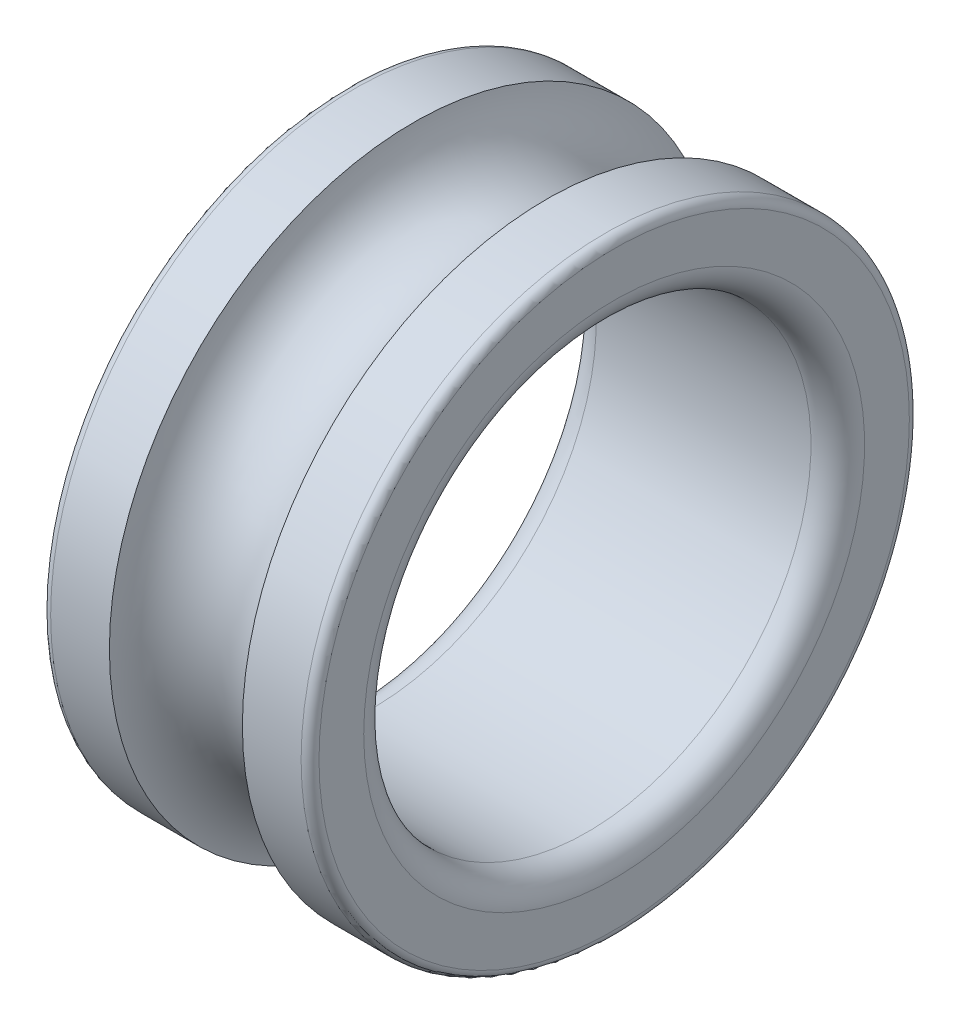
ISO-10303-21;
HEADER;
FILE_DESCRIPTION(('STEP AP214'),'2;1');
FILE_NAME('part.step','',(''),(''),'','','');
FILE_SCHEMA(('AUTOMOTIVE_DESIGN { 1 0 10303 214 1 1 1 1 }'));
ENDSEC;
DATA;
#1=APPLICATION_CONTEXT('core data for automotive mechanical design processes');
#2=APPLICATION_PROTOCOL_DEFINITION('international standard','automotive_design',2000,#1);
#3=PRODUCT_CONTEXT('',#1,'mechanical');
#4=PRODUCT('Part','Part','',(#3));
#5=PRODUCT_RELATED_PRODUCT_CATEGORY('part','',(#4));
#6=PRODUCT_DEFINITION_FORMATION('','',#4);
#7=PRODUCT_DEFINITION_CONTEXT('part definition',#1,'design');
#8=PRODUCT_DEFINITION('design','',#6,#7);
#9=PRODUCT_DEFINITION_SHAPE('','',#8);
#10=(LENGTH_UNIT() NAMED_UNIT(*) SI_UNIT(.MILLI.,.METRE.));
#11=(NAMED_UNIT(*) PLANE_ANGLE_UNIT() SI_UNIT($,.RADIAN.));
#12=(NAMED_UNIT(*) SI_UNIT($,.STERADIAN.) SOLID_ANGLE_UNIT());
#13=UNCERTAINTY_MEASURE_WITH_UNIT(LENGTH_MEASURE(1.E-05),#10,'distance_accuracy_value','');
#14=(GEOMETRIC_REPRESENTATION_CONTEXT(3) GLOBAL_UNCERTAINTY_ASSIGNED_CONTEXT((#13)) GLOBAL_UNIT_ASSIGNED_CONTEXT((#10,
#11,#12)) REPRESENTATION_CONTEXT('',''));
#15=CARTESIAN_POINT('',(0.,0.,0.));
#16=DIRECTION('',(0.,0.,1.));
#17=DIRECTION('',(1.,0.,0.));
#18=AXIS2_PLACEMENT_3D('',#15,#16,#17);
#19=CARTESIAN_POINT('',(2.35,0.,0.));
#20=DIRECTION('',(-1.,0.,0.));
#21=DIRECTION('',(0.,0.,1.));
#22=AXIS2_PLACEMENT_3D('',#19,#20,#21);
#23=TOROIDAL_SURFACE('',#22,3.3,0.099999999999997);
#24=CARTESIAN_POINT('',(2.35,0.,0.));
#25=DIRECTION('',(-1.,0.,0.));
#26=DIRECTION('',(0.,0.,1.));
#27=AXIS2_PLACEMENT_3D('',#24,#25,#26);
#28=CIRCLE('',#27,3.4);
#29=CARTESIAN_POINT('',(2.35,0.,3.4));
#30=VERTEX_POINT('',#29);
#31=EDGE_CURVE('E10',#30,#30,#28,.T.);
#32=ORIENTED_EDGE('',*,*,#31,.T.);
#33=EDGE_LOOP('',(#32));
#34=FACE_BOUND('',#33,.T.);
#35=CARTESIAN_POINT('',(2.25,0.,0.));
#36=DIRECTION('',(-1.,0.,0.));
#37=DIRECTION('',(0.,0.,1.));
#38=AXIS2_PLACEMENT_3D('',#35,#36,#37);
#39=CIRCLE('',#38,3.3);
#40=CARTESIAN_POINT('',(2.25,0.,3.3));
#41=VERTEX_POINT('',#40);
#42=EDGE_CURVE('E69',#41,#41,#39,.T.);
#43=ORIENTED_EDGE('',*,*,#42,.F.);
#44=EDGE_LOOP('',(#43));
#45=FACE_BOUND('',#44,.T.);
#46=ADVANCED_FACE('F35',(#34,#45),#23,.T.);
#47=CARTESIAN_POINT('',(7.0012539936204,0.,0.));
#48=DIRECTION('',(-1.,0.,0.));
#49=DIRECTION('',(0.,0.,1.));
#50=AXIS2_PLACEMENT_3D('',#47,#48,#49);
#51=CYLINDRICAL_SURFACE('',#50,3.4);
#52=CARTESIAN_POINT('',(3.00669656263407,0.,0.));
#53=DIRECTION('',(-1.,0.,0.));
#54=DIRECTION('',(0.,0.,1.));
#55=AXIS2_PLACEMENT_3D('',#52,#53,#54);
#56=CIRCLE('',#55,3.4);
#57=CARTESIAN_POINT('',(3.00669656263407,0.,3.4));
#58=VERTEX_POINT('',#57);
#59=EDGE_CURVE('E41',#58,#58,#56,.T.);
#60=ORIENTED_EDGE('',*,*,#59,.T.);
#61=EDGE_LOOP('',(#60));
#62=FACE_BOUND('',#61,.T.);
#63=ORIENTED_EDGE('',*,*,#31,.F.);
#64=EDGE_LOOP('',(#63));
#65=FACE_BOUND('',#64,.T.);
#66=ADVANCED_FACE('F77',(#62,#65),#51,.T.);
#67=CARTESIAN_POINT('',(3.75,0.,0.));
#68=DIRECTION('',(-1.,0.,0.));
#69=DIRECTION('',(0.,0.,1.));
#70=AXIS2_PLACEMENT_3D('',#67,#68,#69);
#71=TOROIDAL_SURFACE('',#70,3.5,0.75);
#72=CARTESIAN_POINT('',(4.49330343736592,0.,0.));
#73=DIRECTION('',(-1.,0.,0.));
#74=DIRECTION('',(0.,0.,1.));
#75=AXIS2_PLACEMENT_3D('',#72,#73,#74);
#76=CIRCLE('',#75,3.4);
#77=CARTESIAN_POINT('',(4.49330343736592,0.,3.4));
#78=VERTEX_POINT('',#77);
#79=EDGE_CURVE('E45',#78,#78,#76,.T.);
#80=ORIENTED_EDGE('',*,*,#79,.T.);
#81=EDGE_LOOP('',(#80));
#82=FACE_BOUND('',#81,.T.);
#83=ORIENTED_EDGE('',*,*,#59,.F.);
#84=EDGE_LOOP('',(#83));
#85=FACE_BOUND('',#84,.T.);
#86=ADVANCED_FACE('F81',(#82,#85),#71,.F.);
#87=CARTESIAN_POINT('',(7.0012539936204,0.,0.));
#88=DIRECTION('',(-1.,0.,0.));
#89=DIRECTION('',(0.,0.,1.));
#90=AXIS2_PLACEMENT_3D('',#87,#88,#89);
#91=CYLINDRICAL_SURFACE('',#90,3.4);
#92=CARTESIAN_POINT('',(5.15,0.,0.));
#93=DIRECTION('',(-1.,0.,0.));
#94=DIRECTION('',(0.,0.,1.));
#95=AXIS2_PLACEMENT_3D('',#92,#93,#94);
#96=CIRCLE('',#95,3.4);
#97=CARTESIAN_POINT('',(5.15,0.,3.4));
#98=VERTEX_POINT('',#97);
#99=EDGE_CURVE('E49',#98,#98,#96,.T.);
#100=ORIENTED_EDGE('',*,*,#99,.T.);
#101=EDGE_LOOP('',(#100));
#102=FACE_BOUND('',#101,.T.);
#103=ORIENTED_EDGE('',*,*,#79,.F.);
#104=EDGE_LOOP('',(#103));
#105=FACE_BOUND('',#104,.T.);
#106=ADVANCED_FACE('F85',(#102,#105),#91,.T.);
#107=CARTESIAN_POINT('',(5.15,0.,0.));
#108=DIRECTION('',(-1.,0.,0.));
#109=DIRECTION('',(0.,0.,1.));
#110=AXIS2_PLACEMENT_3D('',#107,#108,#109);
#111=TOROIDAL_SURFACE('',#110,3.3,0.0999999999999994);
#112=CARTESIAN_POINT('',(5.25,0.,0.));
#113=DIRECTION('',(-1.,0.,0.));
#114=DIRECTION('',(0.,0.,1.));
#115=AXIS2_PLACEMENT_3D('',#112,#113,#114);
#116=CIRCLE('',#115,3.3);
#117=CARTESIAN_POINT('',(5.25,0.,3.3));
#118=VERTEX_POINT('',#117);
#119=EDGE_CURVE('E54',#118,#118,#116,.T.);
#120=ORIENTED_EDGE('',*,*,#119,.T.);
#121=EDGE_LOOP('',(#120));
#122=FACE_BOUND('',#121,.T.);
#123=ORIENTED_EDGE('',*,*,#99,.F.);
#124=EDGE_LOOP('',(#123));
#125=FACE_BOUND('',#124,.T.);
#126=ADVANCED_FACE('F92',(#122,#125),#111,.T.);
#127=CARTESIAN_POINT('',(5.25,3.3,0.));
#128=DIRECTION('',(1.,0.,0.));
#129=DIRECTION('',(0.,0.,-1.));
#130=AXIS2_PLACEMENT_3D('',#127,#128,#129);
#131=PLANE('',#130);
#132=CARTESIAN_POINT('',(5.25,0.,0.));
#133=DIRECTION('',(-1.,0.,0.));
#134=DIRECTION('',(0.,0.,1.));
#135=AXIS2_PLACEMENT_3D('',#132,#133,#134);
#136=CIRCLE('',#135,2.8);
#137=CARTESIAN_POINT('',(5.25,0.,2.8));
#138=VERTEX_POINT('',#137);
#139=EDGE_CURVE('E57',#138,#138,#136,.T.);
#140=ORIENTED_EDGE('',*,*,#139,.T.);
#141=EDGE_LOOP('',(#140));
#142=FACE_BOUND('',#141,.T.);
#143=ORIENTED_EDGE('',*,*,#119,.F.);
#144=EDGE_LOOP('',(#143));
#145=FACE_BOUND('',#144,.T.);
#146=ADVANCED_FACE('F96',(#142,#145),#131,.T.);
#147=CARTESIAN_POINT('',(4.95,0.,0.));
#148=DIRECTION('',(-1.,0.,0.));
#149=DIRECTION('',(0.,0.,1.));
#150=AXIS2_PLACEMENT_3D('',#147,#148,#149);
#151=TOROIDAL_SURFACE('',#150,2.8,0.300000000000002);
#152=CARTESIAN_POINT('',(4.95,0.,0.));
#153=DIRECTION('',(-1.,0.,0.));
#154=DIRECTION('',(0.,0.,1.));
#155=AXIS2_PLACEMENT_3D('',#152,#153,#154);
#156=CIRCLE('',#155,2.5);
#157=CARTESIAN_POINT('',(4.95,0.,2.5));
#158=VERTEX_POINT('',#157);
#159=EDGE_CURVE('E60',#158,#158,#156,.T.);
#160=ORIENTED_EDGE('',*,*,#159,.T.);
#161=EDGE_LOOP('',(#160));
#162=FACE_BOUND('',#161,.T.);
#163=ORIENTED_EDGE('',*,*,#139,.F.);
#164=EDGE_LOOP('',(#163));
#165=FACE_BOUND('',#164,.T.);
#166=ADVANCED_FACE('F100',(#162,#165),#151,.T.);
#167=CARTESIAN_POINT('',(7.0012539936204,0.,0.));
#168=DIRECTION('',(-1.,0.,0.));
#169=DIRECTION('',(0.,0.,1.));
#170=AXIS2_PLACEMENT_3D('',#167,#168,#169);
#171=CYLINDRICAL_SURFACE('',#170,2.5);
#172=CARTESIAN_POINT('',(2.55,0.,0.));
#173=DIRECTION('',(-1.,0.,0.));
#174=DIRECTION('',(0.,0.,1.));
#175=AXIS2_PLACEMENT_3D('',#172,#173,#174);
#176=CIRCLE('',#175,2.5);
#177=CARTESIAN_POINT('',(2.55,0.,2.5));
#178=VERTEX_POINT('',#177);
#179=EDGE_CURVE('E63',#178,#178,#176,.T.);
#180=ORIENTED_EDGE('',*,*,#179,.T.);
#181=EDGE_LOOP('',(#180));
#182=FACE_BOUND('',#181,.T.);
#183=ORIENTED_EDGE('',*,*,#159,.F.);
#184=EDGE_LOOP('',(#183));
#185=FACE_BOUND('',#184,.T.);
#186=ADVANCED_FACE('F104',(#182,#185),#171,.F.);
#187=CARTESIAN_POINT('',(2.55,0.,0.));
#188=DIRECTION('',(-1.,0.,0.));
#189=DIRECTION('',(0.,0.,1.));
#190=AXIS2_PLACEMENT_3D('',#187,#188,#189);
#191=TOROIDAL_SURFACE('',#190,2.8,0.300000000000002);
#192=CARTESIAN_POINT('',(2.25,0.,0.));
#193=DIRECTION('',(-1.,0.,0.));
#194=DIRECTION('',(0.,0.,1.));
#195=AXIS2_PLACEMENT_3D('',#192,#193,#194);
#196=CIRCLE('',#195,2.8);
#197=CARTESIAN_POINT('',(2.25,0.,2.8));
#198=VERTEX_POINT('',#197);
#199=EDGE_CURVE('E66',#198,#198,#196,.T.);
#200=ORIENTED_EDGE('',*,*,#199,.T.);
#201=EDGE_LOOP('',(#200));
#202=FACE_BOUND('',#201,.T.);
#203=ORIENTED_EDGE('',*,*,#179,.F.);
#204=EDGE_LOOP('',(#203));
#205=FACE_BOUND('',#204,.T.);
#206=ADVANCED_FACE('F108',(#202,#205),#191,.T.);
#207=CARTESIAN_POINT('',(2.25,2.8,0.));
#208=DIRECTION('',(-1.,0.,0.));
#209=DIRECTION('',(0.,0.,1.));
#210=AXIS2_PLACEMENT_3D('',#207,#208,#209);
#211=PLANE('',#210);
#212=ORIENTED_EDGE('',*,*,#42,.T.);
#213=EDGE_LOOP('',(#212));
#214=FACE_BOUND('',#213,.T.);
#215=ORIENTED_EDGE('',*,*,#199,.F.);
#216=EDGE_LOOP('',(#215));
#217=FACE_BOUND('',#216,.T.);
#218=ADVANCED_FACE('F73',(#214,#217),#211,.T.);
#219=CLOSED_SHELL('',(#46,#66,#86,#106,#126,#146,#166,#186,#206,#218));
#220=MANIFOLD_SOLID_BREP('B2',#219);
#221=ADVANCED_BREP_SHAPE_REPRESENTATION('',(#18,#220),#14);
#222=SHAPE_DEFINITION_REPRESENTATION(#9,#221);
ENDSEC;
END-ISO-10303-21;
